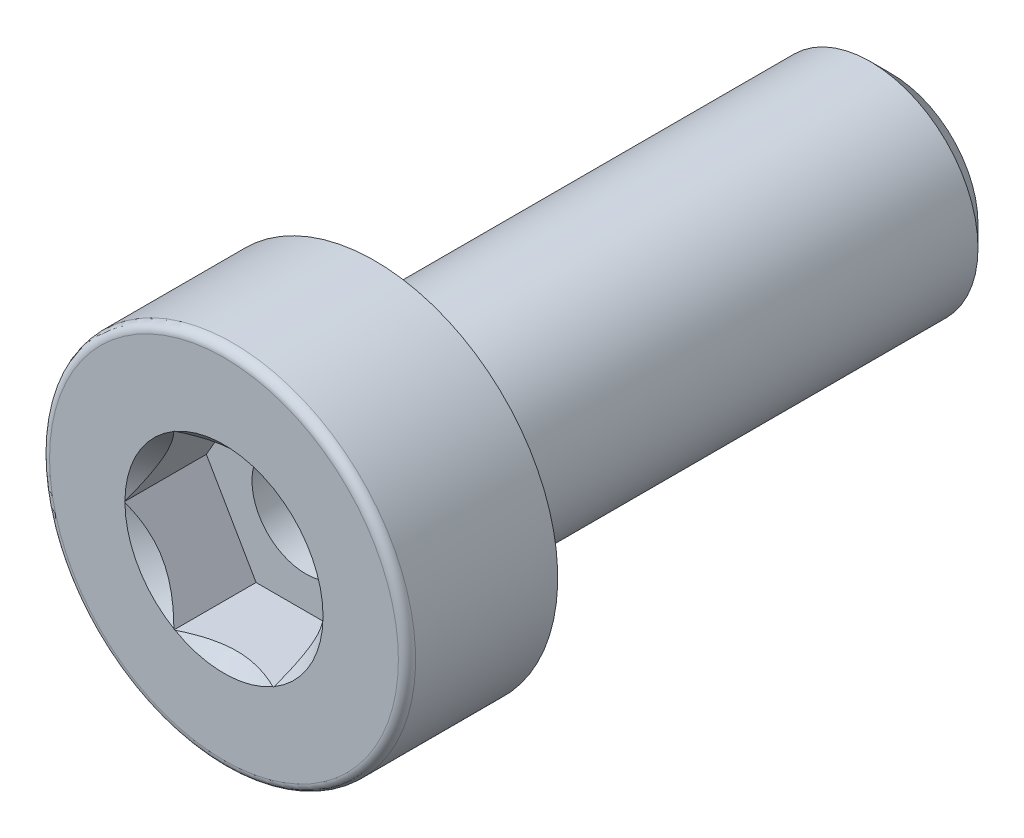
ISO-10303-21;
HEADER;
FILE_DESCRIPTION(('STEP AP214'),'2;1');
FILE_NAME('part.step','',(''),(''),'','','');
FILE_SCHEMA(('AUTOMOTIVE_DESIGN { 1 0 10303 214 1 1 1 1 }'));
ENDSEC;
DATA;
#1=APPLICATION_CONTEXT('core data for automotive mechanical design processes');
#2=APPLICATION_PROTOCOL_DEFINITION('international standard','automotive_design',2000,#1);
#3=PRODUCT_CONTEXT('',#1,'mechanical');
#4=PRODUCT('Part','Part','',(#3));
#5=PRODUCT_RELATED_PRODUCT_CATEGORY('part','',(#4));
#6=PRODUCT_DEFINITION_FORMATION('','',#4);
#7=PRODUCT_DEFINITION_CONTEXT('part definition',#1,'design');
#8=PRODUCT_DEFINITION('design','',#6,#7);
#9=PRODUCT_DEFINITION_SHAPE('','',#8);
#10=(LENGTH_UNIT() NAMED_UNIT(*) SI_UNIT(.MILLI.,.METRE.));
#11=(NAMED_UNIT(*) PLANE_ANGLE_UNIT() SI_UNIT($,.RADIAN.));
#12=(NAMED_UNIT(*) SI_UNIT($,.STERADIAN.) SOLID_ANGLE_UNIT());
#13=UNCERTAINTY_MEASURE_WITH_UNIT(LENGTH_MEASURE(1.E-05),#10,'distance_accuracy_value','');
#14=(GEOMETRIC_REPRESENTATION_CONTEXT(3) GLOBAL_UNCERTAINTY_ASSIGNED_CONTEXT((#13)) GLOBAL_UNIT_ASSIGNED_CONTEXT((#10,
#11,#12)) REPRESENTATION_CONTEXT('',''));
#15=CARTESIAN_POINT('',(0.,0.,0.));
#16=DIRECTION('',(0.,0.,1.));
#17=DIRECTION('',(1.,0.,0.));
#18=AXIS2_PLACEMENT_3D('',#15,#16,#17);
#19=CARTESIAN_POINT('',(-7.75000000000001,-13.4233937586588,3.50000000003092));
#20=DIRECTION('',(0.,0.,1.));
#21=DIRECTION('',(1.,0.,0.));
#22=AXIS2_PLACEMENT_3D('',#19,#20,#21);
#23=CONICAL_SURFACE('',#22,1.25000000000113,1.04719755116303);
#24=CARTESIAN_POINT('',(-7.75000000000001,-13.4233937586588,3.5));
#25=DIRECTION('',(0.,0.,-1.));
#26=DIRECTION('',(-1.,0.,0.));
#27=AXIS2_PLACEMENT_3D('',#24,#25,#26);
#28=CIRCLE('',#27,1.25);
#29=CARTESIAN_POINT('',(-9.00000000000001,-13.4233937586588,3.5));
#30=VERTEX_POINT('',#29);
#31=EDGE_CURVE('E387',#30,#30,#28,.F.);
#32=ORIENTED_EDGE('',*,*,#31,.T.);
#33=EDGE_LOOP('',(#32));
#34=FACE_BOUND('',#33,.T.);
#35=CARTESIAN_POINT('',(-7.75000000000001,-13.4233937586588,2.77831216351387));
#36=VERTEX_POINT('',#35);
#37=VERTEX_LOOP('',#36);
#38=FACE_BOUND('',#37,.T.);
#39=ADVANCED_FACE('F16',(#34,#38),#23,.F.);
#40=CARTESIAN_POINT('',(-7.75000000000001,-13.4233937586588,5.5));
#41=DIRECTION('',(0.,0.,-1.));
#42=DIRECTION('',(-1.,0.,0.));
#43=AXIS2_PLACEMENT_3D('',#40,#41,#42);
#44=CYLINDRICAL_SURFACE('',#43,1.25);
#45=ORIENTED_EDGE('',*,*,#31,.F.);
#46=EDGE_LOOP('',(#45));
#47=FACE_BOUND('',#46,.T.);
#48=CARTESIAN_POINT('',(-7.75000000000001,-13.4233937586588,5.6));
#49=DIRECTION('',(0.,0.,-1.));
#50=DIRECTION('',(-1.,0.,0.));
#51=AXIS2_PLACEMENT_3D('',#48,#49,#50);
#52=CIRCLE('',#51,1.25);
#53=CARTESIAN_POINT('',(-9.00000000000001,-13.4233937586588,5.6));
#54=VERTEX_POINT('',#53);
#55=EDGE_CURVE('E343',#54,#54,#52,.T.);
#56=ORIENTED_EDGE('',*,*,#55,.F.);
#57=EDGE_LOOP('',(#56));
#58=FACE_BOUND('',#57,.T.);
#59=ADVANCED_FACE('F438',(#47,#58),#44,.F.);
#60=CARTESIAN_POINT('',(-7.75000000000001,-13.4233937586588,5.6));
#61=DIRECTION('',(0.,0.,1.));
#62=DIRECTION('',(1.,0.,0.));
#63=AXIS2_PLACEMENT_3D('',#60,#61,#62);
#64=PLANE('',#63);
#65=DIRECTION('',(1.,0.,0.));
#66=VECTOR('',#65,1.);
#67=CARTESIAN_POINT('',(-8.90470053837926,-15.4233937586588,5.6));
#68=LINE('',#67,#66);
#69=CARTESIAN_POINT('',(-8.90470053837925,-15.4233937586588,5.6));
#70=VERTEX_POINT('',#69);
#71=CARTESIAN_POINT('',(-6.59529946162076,-15.4233937586588,5.6));
#72=VERTEX_POINT('',#71);
#73=EDGE_CURVE('E318',#70,#72,#68,.T.);
#74=ORIENTED_EDGE('',*,*,#73,.T.);
#75=DIRECTION('',(0.5,0.866025403784439,0.));
#76=VECTOR('',#75,1.);
#77=CARTESIAN_POINT('',(-6.59529946162076,-15.4233937586588,5.6));
#78=LINE('',#77,#76);
#79=CARTESIAN_POINT('',(-5.44059892324151,-13.4233937586588,5.6));
#80=VERTEX_POINT('',#79);
#81=EDGE_CURVE('E328',#72,#80,#78,.T.);
#82=ORIENTED_EDGE('',*,*,#81,.T.);
#83=DIRECTION('',(-0.500000000000001,0.866025403784438,0.));
#84=VECTOR('',#83,1.);
#85=CARTESIAN_POINT('',(-5.4405989232415,-13.4233937586588,5.6));
#86=LINE('',#85,#84);
#87=CARTESIAN_POINT('',(-6.59529946162076,-11.4233937586588,5.6));
#88=VERTEX_POINT('',#87);
#89=EDGE_CURVE('E337',#80,#88,#86,.T.);
#90=ORIENTED_EDGE('',*,*,#89,.T.);
#91=DIRECTION('',(-1.,0.,0.));
#92=VECTOR('',#91,1.);
#93=CARTESIAN_POINT('',(-6.59529946162076,-11.4233937586588,5.6));
#94=LINE('',#93,#92);
#95=CARTESIAN_POINT('',(-8.90470053837926,-11.4233937586588,5.6));
#96=VERTEX_POINT('',#95);
#97=EDGE_CURVE('E128',#88,#96,#94,.T.);
#98=ORIENTED_EDGE('',*,*,#97,.T.);
#99=DIRECTION('',(-0.5,-0.866025403784439,0.));
#100=VECTOR('',#99,1.);
#101=CARTESIAN_POINT('',(-8.90470053837926,-11.4233937586588,5.6));
#102=LINE('',#101,#100);
#103=CARTESIAN_POINT('',(-10.0594010767585,-13.4233937586588,5.6));
#104=VERTEX_POINT('',#103);
#105=EDGE_CURVE('E348',#96,#104,#102,.T.);
#106=ORIENTED_EDGE('',*,*,#105,.T.);
#107=DIRECTION('',(0.500000000000001,-0.866025403784438,0.));
#108=VECTOR('',#107,1.);
#109=CARTESIAN_POINT('',(-10.0594010767585,-13.4233937586588,5.6));
#110=LINE('',#109,#108);
#111=EDGE_CURVE('E308',#104,#70,#110,.T.);
#112=ORIENTED_EDGE('',*,*,#111,.T.);
#113=EDGE_LOOP('',(#74,#82,#90,#98,#106,#112));
#114=FACE_BOUND('',#113,.T.);
#115=ORIENTED_EDGE('',*,*,#55,.T.);
#116=EDGE_LOOP('',(#115));
#117=FACE_BOUND('',#116,.T.);
#118=ADVANCED_FACE('F435',(#114,#117),#64,.T.);
#119=CARTESIAN_POINT('',(-6.59529946162076,-11.4233937586588,7.5));
#120=DIRECTION('',(0.,1.,0.));
#121=DIRECTION('',(-1.,0.,0.));
#122=AXIS2_PLACEMENT_3D('',#119,#120,#121);
#123=PLANE('',#122);
#124=DIRECTION('',(-1.,0.,0.));
#125=VECTOR('',#124,1.);
#126=CARTESIAN_POINT('',(-6.59529946162076,-11.4233937586588,7.5));
#127=LINE('',#126,#125);
#128=CARTESIAN_POINT('',(-8.90470053837926,-11.4233937586588,7.5));
#129=VERTEX_POINT('',#128);
#130=CARTESIAN_POINT('',(-8.88578166915467,-11.4233937586588,7.49999999996817));
#131=VERTEX_POINT('',#130);
#132=EDGE_CURVE('E119',#129,#131,#127,.F.);
#133=ORIENTED_EDGE('',*,*,#132,.F.);
#134=DIRECTION('',(0.,0.,1.));
#135=VECTOR('',#134,1.);
#136=CARTESIAN_POINT('',(-8.90470053837926,-11.4233937586588,7.5));
#137=LINE('',#136,#135);
#138=EDGE_CURVE('E298',#129,#96,#137,.F.);
#139=ORIENTED_EDGE('',*,*,#138,.T.);
#140=ORIENTED_EDGE('',*,*,#97,.F.);
#141=DIRECTION('',(0.,0.,1.));
#142=VECTOR('',#141,1.);
#143=CARTESIAN_POINT('',(-6.59529946162076,-11.4233937586588,7.5));
#144=LINE('',#143,#142);
#145=CARTESIAN_POINT('',(-6.59529946162076,-11.4233937586588,7.5));
#146=VERTEX_POINT('',#145);
#147=EDGE_CURVE('E333',#88,#146,#144,.T.);
#148=ORIENTED_EDGE('',*,*,#147,.T.);
#149=DIRECTION('',(-1.,0.,0.));
#150=VECTOR('',#149,1.);
#151=CARTESIAN_POINT('',(-6.59529946162076,-11.4233937586588,7.5));
#152=LINE('',#151,#150);
#153=CARTESIAN_POINT('',(-6.61421833084535,-11.4233937586588,7.49999999996817));
#154=VERTEX_POINT('',#153);
#155=EDGE_CURVE('E113',#154,#146,#152,.F.);
#156=ORIENTED_EDGE('',*,*,#155,.F.);
#157=CARTESIAN_POINT('',(-6.61421833084231,-11.4233937586588,7.49999999996967));
#158=CARTESIAN_POINT('',(-6.69246986560371,-11.4233937586588,7.46139126550869));
#159=CARTESIAN_POINT('',(-6.7720183246467,-11.4233937586588,7.42509450591187));
#160=CARTESIAN_POINT('',(-6.93416048945859,-11.4233937586588,7.35871592056121));
#161=CARTESIAN_POINT('',(-7.01676864816183,-11.4233937586588,7.32866971216834));
#162=CARTESIAN_POINT('',(-7.18333080911163,-11.4233937586588,7.27724746086869));
#163=CARTESIAN_POINT('',(-7.26724496590205,-11.4233937586588,7.25574596550051));
#164=CARTESIAN_POINT('',(-7.43686525690513,-11.4233937586588,7.22266553530585));
#165=CARTESIAN_POINT('',(-7.52256661492198,-11.4233937586588,7.21106294551237));
#166=CARTESIAN_POINT('',(-7.67120897584387,-11.4233937586588,7.20057444952879));
#167=CARTESIAN_POINT('',(-7.73397281472532,-11.4233937586588,7.19908068827765));
#168=CARTESIAN_POINT('',(-7.85938715071772,-11.4233937586588,7.20200867405301));
#169=CARTESIAN_POINT('',(-7.92203760144415,-11.4233937586588,7.20643245497149));
#170=CARTESIAN_POINT('',(-8.04673344056696,-11.4233937586588,7.22094215820634));
#171=CARTESIAN_POINT('',(-8.10877812157187,-11.4233937586588,7.23103404393765));
#172=CARTESIAN_POINT('',(-8.23179523498425,-11.4233937586588,7.2563322923858));
#173=CARTESIAN_POINT('',(-8.29276775326558,-11.4233937586588,7.27153824351484));
#174=CARTESIAN_POINT('',(-8.44510307009204,-11.4233937586588,7.31551246792522));
#175=CARTESIAN_POINT('',(-8.53560806284398,-11.4233937586588,7.34720930830145));
#176=CARTESIAN_POINT('',(-8.71319977090982,-11.4233937586588,7.41837525264462));
#177=CARTESIAN_POINT('',(-8.80029669954382,-11.4233937586588,7.45781859302261));
#178=CARTESIAN_POINT('',(-8.8857816691577,-11.4233937586588,7.49999999996967));
#179=B_SPLINE_CURVE_WITH_KNOTS('',3,(#157,#158,#159,#160,#161,#162,#163,#164,#165,#166,#167,
#168,#169,#170,#171,#172,#173,#174,#175,#176,#177,#178),.UNSPECIFIED.,.F.,.F.,(4,2,2,2,2,2,2,2,
2,2,4),(0.,0.261948226178636,0.525350520205879,0.78472845281586,1.04348481161264,
1.23156297192898,1.41970579236232,1.60804692971838,1.79637291271818,2.08361007435315,
2.36990763369225),.UNSPECIFIED.);
#180=EDGE_CURVE('E130',#154,#131,#179,.T.);
#181=ORIENTED_EDGE('',*,*,#180,.T.);
#182=EDGE_LOOP('',(#133,#139,#140,#148,#156,#181));
#183=FACE_BOUND('',#182,.T.);
#184=ADVANCED_FACE('F131',(#183),#123,.F.);
#185=CARTESIAN_POINT('',(-5.4405989232415,-13.4233937586588,7.5));
#186=DIRECTION('',(0.866025403784438,0.500000000000001,0.));
#187=DIRECTION('',(-0.500000000000001,0.866025403784438,0.));
#188=AXIS2_PLACEMENT_3D('',#185,#186,#187);
#189=PLANE('',#188);
#190=DIRECTION('',(-0.500000000000001,0.866025403784438,0.));
#191=VECTOR('',#190,1.);
#192=CARTESIAN_POINT('',(-5.4405989232415,-13.4233937586588,7.5));
#193=LINE('',#192,#191);
#194=CARTESIAN_POINT('',(-6.58584002700846,-11.4397779800182,7.49999999996817));
#195=VERTEX_POINT('',#194);
#196=EDGE_CURVE('E329',#146,#195,#193,.F.);
#197=ORIENTED_EDGE('',*,*,#196,.F.);
#198=ORIENTED_EDGE('',*,*,#147,.F.);
#199=ORIENTED_EDGE('',*,*,#89,.F.);
#200=DIRECTION('',(0.,0.,1.));
#201=VECTOR('',#200,1.);
#202=CARTESIAN_POINT('',(-5.44059892324151,-13.4233937586588,7.5));
#203=LINE('',#202,#201);
#204=CARTESIAN_POINT('',(-5.4405989232415,-13.4233937586588,7.5));
#205=VERTEX_POINT('',#204);
#206=EDGE_CURVE('E323',#80,#205,#203,.T.);
#207=ORIENTED_EDGE('',*,*,#206,.T.);
#208=DIRECTION('',(-0.500000000000001,0.866025403784438,0.));
#209=VECTOR('',#208,1.);
#210=CARTESIAN_POINT('',(-5.4405989232415,-13.4233937586588,7.5));
#211=LINE('',#210,#209);
#212=CARTESIAN_POINT('',(-5.4500583578538,-13.4070095372994,7.49999999996817));
#213=VERTEX_POINT('',#212);
#214=EDGE_CURVE('E127',#213,#205,#211,.F.);
#215=ORIENTED_EDGE('',*,*,#214,.F.);
#216=CARTESIAN_POINT('',(-5.45005835785228,-13.4070095373021,7.49999999996967));
#217=CARTESIAN_POINT('',(-5.48918412523298,-13.3392417203136,7.4613912655087));
#218=CARTESIAN_POINT('',(-5.52895835475448,-13.2703507339504,7.42509450591187));
#219=CARTESIAN_POINT('',(-5.61002943716042,-13.1299315001987,7.35871592056121));
#220=CARTESIAN_POINT('',(-5.65133351651204,-13.0583907362019,7.32866971216835));
#221=CARTESIAN_POINT('',(-5.73461459698694,-12.9141436735101,7.27724746086869));
#222=CARTESIAN_POINT('',(-5.77657167538215,-12.8414718819925,7.25574596550051));
#223=CARTESIAN_POINT('',(-5.86138182088369,-12.6945764009865,7.22266553530585));
#224=CARTESIAN_POINT('',(-5.90423249989211,-12.6203568478051,7.21106294551238));
#225=CARTESIAN_POINT('',(-5.97855368035306,-12.4916287871682,7.20057444952879));
#226=CARTESIAN_POINT('',(-6.00993559979379,-12.4372737082578,7.19908068827766));
#227=CARTESIAN_POINT('',(-6.07264276778999,-12.3286617072897,7.20200867405301));
#228=CARTESIAN_POINT('',(-6.1039679931532,-12.274404825402,7.20643245497149));
#229=CARTESIAN_POINT('',(-6.1663159127146,-12.1664150609755,7.22094215820635));
#230=CARTESIAN_POINT('',(-6.19733825321706,-12.1126827910555,7.23103404393766));
#231=CARTESIAN_POINT('',(-6.25884680992325,-12.0061468457402,7.2563322923858));
#232=CARTESIAN_POINT('',(-6.28933306906392,-11.9533430959758,7.27153824351485));
#233=CARTESIAN_POINT('',(-6.36550072747714,-11.8214168417105,7.31551246792522));
#234=CARTESIAN_POINT('',(-6.41075322385311,-11.743037218818,7.34720930830146));
#235=CARTESIAN_POINT('',(-6.49954907788603,-11.5892382881316,7.41837525264462));
#236=CARTESIAN_POINT('',(-6.54309754220303,-11.5138101353429,7.45781859302262));
#237=CARTESIAN_POINT('',(-6.58584002700998,-11.4397779800155,7.49999999996967));
#238=B_SPLINE_CURVE_WITH_KNOTS('',3,(#216,#217,#218,#219,#220,#221,#222,#223,#224,#225,#226,
#227,#228,#229,#230,#231,#232,#233,#234,#235,#236,#237),.UNSPECIFIED.,.F.,.F.,(4,2,2,2,2,2,2,2,
2,2,4),(0.,0.261948226178634,0.525350520205877,0.784728452815856,1.04348481161263,
1.23156297192898,1.41970579236232,1.60804692971837,1.79637291271818,2.08361007435314,
2.36990763369225),.UNSPECIFIED.);
#239=EDGE_CURVE('E133',#213,#195,#238,.T.);
#240=ORIENTED_EDGE('',*,*,#239,.T.);
#241=EDGE_LOOP('',(#197,#198,#199,#207,#215,#240));
#242=FACE_BOUND('',#241,.T.);
#243=ADVANCED_FACE('F204',(#242),#189,.F.);
#244=CARTESIAN_POINT('',(-6.59529946162076,-15.4233937586588,7.5));
#245=DIRECTION('',(0.866025403784439,-0.5,0.));
#246=DIRECTION('',(0.5,0.866025403784439,0.));
#247=AXIS2_PLACEMENT_3D('',#244,#245,#246);
#248=PLANE('',#247);
#249=DIRECTION('',(0.5,0.866025403784439,0.));
#250=VECTOR('',#249,1.);
#251=CARTESIAN_POINT('',(-6.59529946162076,-15.4233937586588,7.5));
#252=LINE('',#251,#250);
#253=CARTESIAN_POINT('',(-5.4500583578538,-13.4397779800182,7.49999999996817));
#254=VERTEX_POINT('',#253);
#255=EDGE_CURVE('E319',#205,#254,#252,.F.);
#256=ORIENTED_EDGE('',*,*,#255,.F.);
#257=ORIENTED_EDGE('',*,*,#206,.F.);
#258=ORIENTED_EDGE('',*,*,#81,.F.);
#259=DIRECTION('',(0.,0.,1.));
#260=VECTOR('',#259,1.);
#261=CARTESIAN_POINT('',(-6.59529946162076,-15.4233937586588,7.5));
#262=LINE('',#261,#260);
#263=CARTESIAN_POINT('',(-6.59529946162076,-15.4233937586588,7.5));
#264=VERTEX_POINT('',#263);
#265=EDGE_CURVE('E313',#72,#264,#262,.T.);
#266=ORIENTED_EDGE('',*,*,#265,.T.);
#267=DIRECTION('',(0.5,0.866025403784439,0.));
#268=VECTOR('',#267,1.);
#269=CARTESIAN_POINT('',(-6.59529946162076,-15.4233937586588,7.5));
#270=LINE('',#269,#268);
#271=CARTESIAN_POINT('',(-6.58584002700847,-15.4070095372994,7.49999999996817));
#272=VERTEX_POINT('',#271);
#273=EDGE_CURVE('E326',#272,#264,#270,.F.);
#274=ORIENTED_EDGE('',*,*,#273,.F.);
#275=CARTESIAN_POINT('',(-6.58584002700998,-15.4070095373021,7.49999999996967));
#276=CARTESIAN_POINT('',(-6.54671425962928,-15.3392417203136,7.46139126550869));
#277=CARTESIAN_POINT('',(-6.50694003010779,-15.2703507339504,7.42509450591187));
#278=CARTESIAN_POINT('',(-6.42586894770185,-15.1299315001987,7.35871592056121));
#279=CARTESIAN_POINT('',(-6.38456486835022,-15.0583907362019,7.32866971216834));
#280=CARTESIAN_POINT('',(-6.30128378787533,-14.9141436735101,7.27724746086869));
#281=CARTESIAN_POINT('',(-6.25932670948011,-14.8414718819925,7.2557459655005));
#282=CARTESIAN_POINT('',(-6.17451656397857,-14.6945764009865,7.22266553530585));
#283=CARTESIAN_POINT('',(-6.13166588497015,-14.6203568478051,7.21106294551237));
#284=CARTESIAN_POINT('',(-6.0573447045092,-14.4916287871682,7.20057444952879));
#285=CARTESIAN_POINT('',(-6.02596278506848,-14.4372737082578,7.19908068827765));
#286=CARTESIAN_POINT('',(-5.96325561707228,-14.3286617072897,7.20200867405301));
#287=CARTESIAN_POINT('',(-5.93193039170906,-14.274404825402,7.20643245497149));
#288=CARTESIAN_POINT('',(-5.86958247214766,-14.1664150609755,7.22094215820634));
#289=CARTESIAN_POINT('',(-5.8385601316452,-14.1126827910555,7.23103404393765));
#290=CARTESIAN_POINT('',(-5.77705157493901,-14.0061468457402,7.25633229238579));
#291=CARTESIAN_POINT('',(-5.74656531579835,-13.9533430959758,7.27153824351484));
#292=CARTESIAN_POINT('',(-5.67039765738512,-13.8214168417105,7.31551246792522));
#293=CARTESIAN_POINT('',(-5.62514516100915,-13.743037218818,7.34720930830145));
#294=CARTESIAN_POINT('',(-5.53634930697623,-13.5892382881316,7.41837525264462));
#295=CARTESIAN_POINT('',(-5.49280084265923,-13.5138101353429,7.45781859302261));
#296=CARTESIAN_POINT('',(-5.45005835785228,-13.4397779800155,7.49999999996967));
#297=B_SPLINE_CURVE_WITH_KNOTS('',3,(#275,#276,#277,#278,#279,#280,#281,#282,#283,#284,#285,
#286,#287,#288,#289,#290,#291,#292,#293,#294,#295,#296),.UNSPECIFIED.,.F.,.F.,(4,2,2,2,2,2,2,2,
2,2,4),(0.,0.261948226178634,0.525350520205877,0.784728452815858,1.04348481161264,
1.23156297192898,1.41970579236232,1.60804692971837,1.79637291271818,2.08361007435315,
2.36990763369226),.UNSPECIFIED.);
#298=EDGE_CURVE('E188',#272,#254,#297,.T.);
#299=ORIENTED_EDGE('',*,*,#298,.T.);
#300=EDGE_LOOP('',(#256,#257,#258,#266,#274,#299));
#301=FACE_BOUND('',#300,.T.);
#302=ADVANCED_FACE('F198',(#301),#248,.F.);
#303=CARTESIAN_POINT('',(-8.90470053837926,-15.4233937586588,7.5));
#304=DIRECTION('',(0.,-1.,0.));
#305=DIRECTION('',(1.,0.,0.));
#306=AXIS2_PLACEMENT_3D('',#303,#304,#305);
#307=PLANE('',#306);
#308=DIRECTION('',(1.,0.,0.));
#309=VECTOR('',#308,1.);
#310=CARTESIAN_POINT('',(-8.90470053837926,-15.4233937586588,7.5));
#311=LINE('',#310,#309);
#312=CARTESIAN_POINT('',(-6.61421833084535,-15.4233937586588,7.49999999996817));
#313=VERTEX_POINT('',#312);
#314=EDGE_CURVE('E309',#264,#313,#311,.F.);
#315=ORIENTED_EDGE('',*,*,#314,.F.);
#316=ORIENTED_EDGE('',*,*,#265,.F.);
#317=ORIENTED_EDGE('',*,*,#73,.F.);
#318=DIRECTION('',(0.,0.,1.));
#319=VECTOR('',#318,1.);
#320=CARTESIAN_POINT('',(-8.90470053837925,-15.4233937586588,7.5));
#321=LINE('',#320,#319);
#322=CARTESIAN_POINT('',(-8.90470053837925,-15.4233937586588,7.5));
#323=VERTEX_POINT('',#322);
#324=EDGE_CURVE('E303',#70,#323,#321,.T.);
#325=ORIENTED_EDGE('',*,*,#324,.T.);
#326=DIRECTION('',(1.,0.,0.));
#327=VECTOR('',#326,1.);
#328=CARTESIAN_POINT('',(-8.90470053837926,-15.4233937586588,7.5));
#329=LINE('',#328,#327);
#330=CARTESIAN_POINT('',(-8.88578166915467,-15.4233937586588,7.49999999996817));
#331=VERTEX_POINT('',#330);
#332=EDGE_CURVE('E316',#331,#323,#329,.F.);
#333=ORIENTED_EDGE('',*,*,#332,.F.);
#334=CARTESIAN_POINT('',(-8.8857816691577,-15.4233937586588,7.49999999996967));
#335=CARTESIAN_POINT('',(-8.8075301343963,-15.4233937586588,7.46139126550869));
#336=CARTESIAN_POINT('',(-8.72798167535332,-15.4233937586588,7.42509450591187));
#337=CARTESIAN_POINT('',(-8.56583951054143,-15.4233937586588,7.35871592056121));
#338=CARTESIAN_POINT('',(-8.48323135183819,-15.4233937586588,7.32866971216834));
#339=CARTESIAN_POINT('',(-8.31666919088839,-15.4233937586588,7.27724746086869));
#340=CARTESIAN_POINT('',(-8.23275503409797,-15.4233937586588,7.25574596550051));
#341=CARTESIAN_POINT('',(-8.06313474309489,-15.4233937586588,7.22266553530585));
#342=CARTESIAN_POINT('',(-7.97743338507805,-15.4233937586588,7.21106294551237));
#343=CARTESIAN_POINT('',(-7.82879102415615,-15.4233937586588,7.20057444952879));
#344=CARTESIAN_POINT('',(-7.7660271852747,-15.4233937586588,7.19908068827765));
#345=CARTESIAN_POINT('',(-7.6406128492823,-15.4233937586588,7.20200867405301));
#346=CARTESIAN_POINT('',(-7.57796239855588,-15.4233937586588,7.20643245497149));
#347=CARTESIAN_POINT('',(-7.45326655943307,-15.4233937586588,7.22094215820634));
#348=CARTESIAN_POINT('',(-7.39122187842815,-15.4233937586588,7.23103404393765));
#349=CARTESIAN_POINT('',(-7.26820476501578,-15.4233937586588,7.2563322923858));
#350=CARTESIAN_POINT('',(-7.20723224673444,-15.4233937586588,7.27153824351484));
#351=CARTESIAN_POINT('',(-7.05489692990799,-15.4233937586588,7.31551246792522));
#352=CARTESIAN_POINT('',(-6.96439193715604,-15.4233937586588,7.34720930830145));
#353=CARTESIAN_POINT('',(-6.7868002290902,-15.4233937586588,7.41837525264462));
#354=CARTESIAN_POINT('',(-6.6997033004562,-15.4233937586588,7.45781859302262));
#355=CARTESIAN_POINT('',(-6.61421833084231,-15.4233937586588,7.49999999996967));
#356=B_SPLINE_CURVE_WITH_KNOTS('',3,(#334,#335,#336,#337,#338,#339,#340,#341,#342,#343,#344,
#345,#346,#347,#348,#349,#350,#351,#352,#353,#354,#355),.UNSPECIFIED.,.F.,.F.,(4,2,2,2,2,2,2,2,
2,2,4),(0.,0.261948226178633,0.525350520205873,0.784728452815851,1.04348481161263,
1.23156297192897,1.41970579236231,1.60804692971836,1.79637291271817,2.08361007435314,
2.36990763369225),.UNSPECIFIED.);
#357=EDGE_CURVE('E181',#331,#313,#356,.T.);
#358=ORIENTED_EDGE('',*,*,#357,.T.);
#359=EDGE_LOOP('',(#315,#316,#317,#325,#333,#358));
#360=FACE_BOUND('',#359,.T.);
#361=ADVANCED_FACE('F194',(#360),#307,.F.);
#362=CARTESIAN_POINT('',(-10.0594010767585,-13.4233937586588,7.5));
#363=DIRECTION('',(-0.866025403784438,-0.500000000000001,0.));
#364=DIRECTION('',(0.500000000000001,-0.866025403784438,0.));
#365=AXIS2_PLACEMENT_3D('',#362,#363,#364);
#366=PLANE('',#365);
#367=DIRECTION('',(0.500000000000001,-0.866025403784438,0.));
#368=VECTOR('',#367,1.);
#369=CARTESIAN_POINT('',(-10.0594010767585,-13.4233937586588,7.5));
#370=LINE('',#369,#368);
#371=CARTESIAN_POINT('',(-8.91415997299153,-15.4070095372994,7.49999999996817));
#372=VERTEX_POINT('',#371);
#373=EDGE_CURVE('E299',#323,#372,#370,.F.);
#374=ORIENTED_EDGE('',*,*,#373,.F.);
#375=ORIENTED_EDGE('',*,*,#324,.F.);
#376=ORIENTED_EDGE('',*,*,#111,.F.);
#377=DIRECTION('',(0.,0.,1.));
#378=VECTOR('',#377,1.);
#379=CARTESIAN_POINT('',(-10.0594010767585,-13.4233937586588,7.5));
#380=LINE('',#379,#378);
#381=CARTESIAN_POINT('',(-10.0594010767585,-13.4233937586588,7.5));
#382=VERTEX_POINT('',#381);
#383=EDGE_CURVE('E294',#104,#382,#380,.T.);
#384=ORIENTED_EDGE('',*,*,#383,.T.);
#385=DIRECTION('',(0.500000000000001,-0.866025403784438,0.));
#386=VECTOR('',#385,1.);
#387=CARTESIAN_POINT('',(-10.0594010767585,-13.4233937586588,7.5));
#388=LINE('',#387,#386);
#389=CARTESIAN_POINT('',(-10.0499416421462,-13.4397779800181,7.49999999996817));
#390=VERTEX_POINT('',#389);
#391=EDGE_CURVE('E306',#390,#382,#388,.F.);
#392=ORIENTED_EDGE('',*,*,#391,.F.);
#393=CARTESIAN_POINT('',(-10.0499416421477,-13.4397779800155,7.49999999996966));
#394=CARTESIAN_POINT('',(-10.010815874767,-13.507545797004,7.46139126550868));
#395=CARTESIAN_POINT('',(-9.97104164524553,-13.5764367833672,7.42509450591186));
#396=CARTESIAN_POINT('',(-9.88997056283959,-13.7168560171189,7.3587159205612));
#397=CARTESIAN_POINT('',(-9.84866648348797,-13.7883967811157,7.32866971216833));
#398=CARTESIAN_POINT('',(-9.76538540301307,-13.9326438438075,7.27724746086868));
#399=CARTESIAN_POINT('',(-9.72342832461786,-14.0053156353251,7.25574596550049));
#400=CARTESIAN_POINT('',(-9.63861817911632,-14.1522111163311,7.22266553530584));
#401=CARTESIAN_POINT('',(-9.59576750010789,-14.2264306695125,7.21106294551236));
#402=CARTESIAN_POINT('',(-9.52144631964695,-14.3551587301494,7.20057444952878));
#403=CARTESIAN_POINT('',(-9.49006440020622,-14.4095138090598,7.19908068827764));
#404=CARTESIAN_POINT('',(-9.42735723221002,-14.5181258100279,7.202008674053));
#405=CARTESIAN_POINT('',(-9.39603200684681,-14.5723826919156,7.20643245497148));
#406=CARTESIAN_POINT('',(-9.33368408728541,-14.6803724563421,7.22094215820633));
#407=CARTESIAN_POINT('',(-9.30266174678295,-14.7341047262621,7.23103404393764));
#408=CARTESIAN_POINT('',(-9.24115319007676,-14.8406406715774,7.25633229238578));
#409=CARTESIAN_POINT('',(-9.21066693093609,-14.8934444213418,7.27153824351483));
#410=CARTESIAN_POINT('',(-9.13449927252286,-15.025370675607,7.3155124679252));
#411=CARTESIAN_POINT('',(-9.08924677614689,-15.1037502984995,7.34720930830144));
#412=CARTESIAN_POINT('',(-9.00045092211397,-15.257549229186,7.4183752526446));
#413=CARTESIAN_POINT('',(-8.95690245779697,-15.3329773819747,7.4578185930226));
#414=CARTESIAN_POINT('',(-8.91415997299002,-15.4070095373021,7.49999999996966));
#415=B_SPLINE_CURVE_WITH_KNOTS('',3,(#393,#394,#395,#396,#397,#398,#399,#400,#401,#402,#403,
#404,#405,#406,#407,#408,#409,#410,#411,#412,#413,#414),.UNSPECIFIED.,.F.,.F.,(4,2,2,2,2,2,2,2,
2,2,4),(0.,0.261948226178637,0.525350520205877,0.784728452815857,1.04348481161263,
1.23156297192897,1.41970579236231,1.60804692971837,1.79637291271817,2.08361007435315,
2.36990763369226),.UNSPECIFIED.);
#416=EDGE_CURVE('E144',#390,#372,#415,.T.);
#417=ORIENTED_EDGE('',*,*,#416,.T.);
#418=EDGE_LOOP('',(#374,#375,#376,#384,#392,#417));
#419=FACE_BOUND('',#418,.T.);
#420=ADVANCED_FACE('F197',(#419),#366,.F.);
#421=CARTESIAN_POINT('',(-8.90470053837926,-11.4233937586588,7.5));
#422=DIRECTION('',(-0.866025403784439,0.5,0.));
#423=DIRECTION('',(-0.5,-0.866025403784439,0.));
#424=AXIS2_PLACEMENT_3D('',#421,#422,#423);
#425=PLANE('',#424);
#426=DIRECTION('',(-0.5,-0.866025403784439,0.));
#427=VECTOR('',#426,1.);
#428=CARTESIAN_POINT('',(-8.90470053837926,-11.4233937586588,7.5));
#429=LINE('',#428,#427);
#430=CARTESIAN_POINT('',(-10.0499416421462,-13.4070095372994,7.49999999996817));
#431=VERTEX_POINT('',#430);
#432=EDGE_CURVE('E134',#382,#431,#429,.F.);
#433=ORIENTED_EDGE('',*,*,#432,.F.);
#434=ORIENTED_EDGE('',*,*,#383,.F.);
#435=ORIENTED_EDGE('',*,*,#105,.F.);
#436=ORIENTED_EDGE('',*,*,#138,.F.);
#437=DIRECTION('',(-0.5,-0.866025403784439,0.));
#438=VECTOR('',#437,1.);
#439=CARTESIAN_POINT('',(-8.90470053837926,-11.4233937586588,7.5));
#440=LINE('',#439,#438);
#441=CARTESIAN_POINT('',(-8.91415997299156,-11.4397779800182,7.49999999996817));
#442=VERTEX_POINT('',#441);
#443=EDGE_CURVE('E124',#442,#129,#440,.F.);
#444=ORIENTED_EDGE('',*,*,#443,.F.);
#445=CARTESIAN_POINT('',(-8.91415997299004,-11.4397779800155,7.49999999996967));
#446=CARTESIAN_POINT('',(-8.95328574037074,-11.507545797004,7.46139126550869));
#447=CARTESIAN_POINT('',(-8.99305996989223,-11.5764367833672,7.42509450591187));
#448=CARTESIAN_POINT('',(-9.07413105229817,-11.7168560171189,7.35871592056121));
#449=CARTESIAN_POINT('',(-9.11543513164979,-11.7883967811157,7.32866971216834));
#450=CARTESIAN_POINT('',(-9.19871621212469,-11.9326438438075,7.27724746086869));
#451=CARTESIAN_POINT('',(-9.2406732905199,-12.0053156353251,7.2557459655005));
#452=CARTESIAN_POINT('',(-9.32548343602145,-12.1522111163311,7.22266553530585));
#453=CARTESIAN_POINT('',(-9.36833411502987,-12.2264306695125,7.21106294551237));
#454=CARTESIAN_POINT('',(-9.44265529549082,-12.3551587301494,7.20057444952879));
#455=CARTESIAN_POINT('',(-9.47403721493154,-12.4095138090598,7.19908068827765));
#456=CARTESIAN_POINT('',(-9.53674438292774,-12.5181258100279,7.20200867405301));
#457=CARTESIAN_POINT('',(-9.56806960829095,-12.5723826919156,7.20643245497149));
#458=CARTESIAN_POINT('',(-9.63041752785236,-12.6803724563421,7.22094215820634));
#459=CARTESIAN_POINT('',(-9.66143986835481,-12.7341047262621,7.23103404393765));
#460=CARTESIAN_POINT('',(-9.722948425061,-12.8406406715774,7.25633229238579));
#461=CARTESIAN_POINT('',(-9.75343468420167,-12.8934444213418,7.27153824351484));
#462=CARTESIAN_POINT('',(-9.8296023426149,-13.025370675607,7.31551246792522));
#463=CARTESIAN_POINT('',(-9.87485483899087,-13.1037502984996,7.34720930830145));
#464=CARTESIAN_POINT('',(-9.96365069302379,-13.257549229186,7.41837525264461));
#465=CARTESIAN_POINT('',(-10.0071991573408,-13.3329773819747,7.45781859302261));
#466=CARTESIAN_POINT('',(-10.0499416421477,-13.4070095373021,7.49999999996967));
#467=B_SPLINE_CURVE_WITH_KNOTS('',3,(#445,#446,#447,#448,#449,#450,#451,#452,#453,#454,#455,
#456,#457,#458,#459,#460,#461,#462,#463,#464,#465,#466),.UNSPECIFIED.,.F.,.F.,(4,2,2,2,2,2,2,2,
2,2,4),(0.,0.261948226178632,0.525350520205876,0.784728452815856,1.04348481161263,
1.23156297192897,1.41970579236231,1.60804692971836,1.79637291271817,2.08361007435314,
2.36990763369225),.UNSPECIFIED.);
#468=EDGE_CURVE('E138',#442,#431,#467,.T.);
#469=ORIENTED_EDGE('',*,*,#468,.T.);
#470=EDGE_LOOP('',(#433,#434,#435,#436,#444,#469));
#471=FACE_BOUND('',#470,.T.);
#472=ADVANCED_FACE('F159',(#471),#425,.F.);
#473=CARTESIAN_POINT('',(-7.75000000000001,-13.4233937586588,7.49999999987949));
#474=DIRECTION('',(0.,0.,1.));
#475=DIRECTION('',(1.,0.,0.));
#476=AXIS2_PLACEMENT_3D('',#473,#474,#475);
#477=CONICAL_SURFACE('',#476,2.29999999990866,0.785398163396903);
#478=CARTESIAN_POINT('',(-7.75000000000001,-13.4233937586588,7.49999999993634));
#479=DIRECTION('',(0.,0.,1.));
#480=DIRECTION('',(1.,0.,0.));
#481=AXIS2_PLACEMENT_3D('',#478,#479,#480);
#482=CIRCLE('',#481,2.2999999999655);
#483=EDGE_CURVE('E122',#131,#154,#482,.F.);
#484=ORIENTED_EDGE('',*,*,#483,.F.);
#485=ORIENTED_EDGE('',*,*,#180,.F.);
#486=EDGE_LOOP('',(#484,#485));
#487=FACE_BOUND('',#486,.T.);
#488=ADVANCED_FACE('F136',(#487),#477,.F.);
#489=CARTESIAN_POINT('',(-7.75000000000001,-13.4233937586588,7.49999999987949));
#490=DIRECTION('',(0.,0.,1.));
#491=DIRECTION('',(1.,0.,0.));
#492=AXIS2_PLACEMENT_3D('',#489,#490,#491);
#493=CONICAL_SURFACE('',#492,2.29999999990866,0.785398163396903);
#494=CARTESIAN_POINT('',(-7.75000000000001,-13.4233937586588,7.49999999993634));
#495=DIRECTION('',(0.,0.,1.));
#496=DIRECTION('',(1.,0.,0.));
#497=AXIS2_PLACEMENT_3D('',#494,#495,#496);
#498=CIRCLE('',#497,2.2999999999655);
#499=EDGE_CURVE('E137',#195,#213,#498,.F.);
#500=ORIENTED_EDGE('',*,*,#499,.F.);
#501=ORIENTED_EDGE('',*,*,#239,.F.);
#502=EDGE_LOOP('',(#500,#501));
#503=FACE_BOUND('',#502,.T.);
#504=ADVANCED_FACE('F220',(#503),#493,.F.);
#505=CARTESIAN_POINT('',(-7.75000000000001,-13.4233937586588,7.49999999987949));
#506=DIRECTION('',(0.,0.,1.));
#507=DIRECTION('',(1.,0.,0.));
#508=AXIS2_PLACEMENT_3D('',#505,#506,#507);
#509=CONICAL_SURFACE('',#508,2.29999999990866,0.785398163396903);
#510=CARTESIAN_POINT('',(-7.75000000000001,-13.4233937586588,7.49999999993634));
#511=DIRECTION('',(0.,0.,1.));
#512=DIRECTION('',(1.,0.,0.));
#513=AXIS2_PLACEMENT_3D('',#510,#511,#512);
#514=CIRCLE('',#513,2.2999999999655);
#515=EDGE_CURVE('E141',#254,#272,#514,.F.);
#516=ORIENTED_EDGE('',*,*,#515,.F.);
#517=ORIENTED_EDGE('',*,*,#298,.F.);
#518=EDGE_LOOP('',(#516,#517));
#519=FACE_BOUND('',#518,.T.);
#520=ADVANCED_FACE('F177',(#519),#509,.F.);
#521=CARTESIAN_POINT('',(-7.75000000000001,-13.4233937586588,7.49999999987949));
#522=DIRECTION('',(0.,0.,1.));
#523=DIRECTION('',(1.,0.,0.));
#524=AXIS2_PLACEMENT_3D('',#521,#522,#523);
#525=CONICAL_SURFACE('',#524,2.29999999990866,0.785398163396903);
#526=CARTESIAN_POINT('',(-7.75000000000001,-13.4233937586588,7.49999999993634));
#527=DIRECTION('',(0.,0.,1.));
#528=DIRECTION('',(1.,0.,0.));
#529=AXIS2_PLACEMENT_3D('',#526,#527,#528);
#530=CIRCLE('',#529,2.2999999999655);
#531=EDGE_CURVE('E401',#313,#331,#530,.F.);
#532=ORIENTED_EDGE('',*,*,#531,.F.);
#533=ORIENTED_EDGE('',*,*,#357,.F.);
#534=EDGE_LOOP('',(#532,#533));
#535=FACE_BOUND('',#534,.T.);
#536=ADVANCED_FACE('F172',(#535),#525,.F.);
#537=CARTESIAN_POINT('',(-7.75000000000001,-13.4233937586588,7.49999999987949));
#538=DIRECTION('',(0.,0.,1.));
#539=DIRECTION('',(1.,0.,0.));
#540=AXIS2_PLACEMENT_3D('',#537,#538,#539);
#541=CONICAL_SURFACE('',#540,2.29999999990866,0.785398163396903);
#542=CARTESIAN_POINT('',(-7.75000000000001,-13.4233937586588,7.49999999993634));
#543=DIRECTION('',(0.,0.,1.));
#544=DIRECTION('',(1.,0.,0.));
#545=AXIS2_PLACEMENT_3D('',#542,#543,#544);
#546=CIRCLE('',#545,2.2999999999655);
#547=EDGE_CURVE('E398',#372,#390,#546,.F.);
#548=ORIENTED_EDGE('',*,*,#547,.F.);
#549=ORIENTED_EDGE('',*,*,#416,.F.);
#550=EDGE_LOOP('',(#548,#549));
#551=FACE_BOUND('',#550,.T.);
#552=ADVANCED_FACE('F166',(#551),#541,.F.);
#553=CARTESIAN_POINT('',(-7.75000000000001,-13.4233937586588,7.49999999987949));
#554=DIRECTION('',(0.,0.,1.));
#555=DIRECTION('',(1.,0.,0.));
#556=AXIS2_PLACEMENT_3D('',#553,#554,#555);
#557=CONICAL_SURFACE('',#556,2.29999999990866,0.785398163396903);
#558=CARTESIAN_POINT('',(-7.75000000000001,-13.4233937586588,7.49999999993634));
#559=DIRECTION('',(0.,0.,1.));
#560=DIRECTION('',(1.,0.,0.));
#561=AXIS2_PLACEMENT_3D('',#558,#559,#560);
#562=CIRCLE('',#561,2.2999999999655);
#563=EDGE_CURVE('E396',#431,#442,#562,.F.);
#564=ORIENTED_EDGE('',*,*,#563,.F.);
#565=ORIENTED_EDGE('',*,*,#468,.F.);
#566=EDGE_LOOP('',(#564,#565));
#567=FACE_BOUND('',#566,.T.);
#568=ADVANCED_FACE('F162',(#567),#557,.F.);
#569=CARTESIAN_POINT('',(-9.33750000000001,-16.1730244156744,7.5));
#570=DIRECTION('',(0.,0.,1.));
#571=DIRECTION('',(1.,0.,0.));
#572=AXIS2_PLACEMENT_3D('',#569,#570,#571);
#573=PLANE('',#572);
#574=ORIENTED_EDGE('',*,*,#432,.T.);
#575=ORIENTED_EDGE('',*,*,#563,.T.);
#576=ORIENTED_EDGE('',*,*,#443,.T.);
#577=ORIENTED_EDGE('',*,*,#132,.T.);
#578=ORIENTED_EDGE('',*,*,#483,.T.);
#579=ORIENTED_EDGE('',*,*,#155,.T.);
#580=ORIENTED_EDGE('',*,*,#196,.T.);
#581=ORIENTED_EDGE('',*,*,#499,.T.);
#582=ORIENTED_EDGE('',*,*,#214,.T.);
#583=ORIENTED_EDGE('',*,*,#255,.T.);
#584=ORIENTED_EDGE('',*,*,#515,.T.);
#585=ORIENTED_EDGE('',*,*,#273,.T.);
#586=ORIENTED_EDGE('',*,*,#314,.T.);
#587=ORIENTED_EDGE('',*,*,#531,.T.);
#588=ORIENTED_EDGE('',*,*,#332,.T.);
#589=ORIENTED_EDGE('',*,*,#373,.T.);
#590=ORIENTED_EDGE('',*,*,#547,.T.);
#591=ORIENTED_EDGE('',*,*,#391,.T.);
#592=EDGE_LOOP('',(#574,#575,#576,#577,#578,#579,#580,#581,#582,#583,#584,#585,#586,#587,#588,
#589,#590,#591));
#593=FACE_BOUND('',#592,.T.);
#594=CARTESIAN_POINT('',(-7.75000000000001,-13.4233937586588,7.5));
#595=DIRECTION('',(0.,0.,-1.));
#596=DIRECTION('',(0.499999999999999,0.866025403784439,0.));
#597=AXIS2_PLACEMENT_3D('',#594,#595,#596);
#598=CIRCLE('',#597,4.05000000000001);
#599=CARTESIAN_POINT('',(-5.72500000000001,-9.91599087333181,7.5));
#600=VERTEX_POINT('',#599);
#601=CARTESIAN_POINT('',(-9.77500000000001,-16.9307966439858,7.5));
#602=VERTEX_POINT('',#601);
#603=EDGE_CURVE('E35',#600,#602,#598,.T.);
#604=ORIENTED_EDGE('',*,*,#603,.F.);
#605=CARTESIAN_POINT('',(-7.75000000000001,-13.4233937586588,7.5));
#606=DIRECTION('',(0.,0.,-1.));
#607=DIRECTION('',(-0.5,-0.866025403784439,0.));
#608=AXIS2_PLACEMENT_3D('',#605,#606,#607);
#609=CIRCLE('',#608,4.05000000000002);
#610=EDGE_CURVE('E276',#602,#600,#609,.T.);
#611=ORIENTED_EDGE('',*,*,#610,.F.);
#612=EDGE_LOOP('',(#604,#611));
#613=FACE_BOUND('',#612,.T.);
#614=ADVANCED_FACE('F120',(#593,#613),#573,.T.);
#615=CARTESIAN_POINT('',(-7.75000000000001,-13.4233937586588,7.3));
#616=DIRECTION('',(0.,0.,1.));
#617=DIRECTION('',(-0.5,-0.866025403784439,0.));
#618=AXIS2_PLACEMENT_3D('',#615,#616,#617);
#619=TOROIDAL_SURFACE('',#618,4.05,0.199999999999999);
#620=ORIENTED_EDGE('',*,*,#603,.T.);
#621=ORIENTED_EDGE('',*,*,#610,.T.);
#622=EDGE_LOOP('',(#620,#621));
#623=FACE_BOUND('',#622,.T.);
#624=CARTESIAN_POINT('',(-7.75000000000001,-13.4233937586588,7.3));
#625=DIRECTION('',(0.,0.,-1.));
#626=DIRECTION('',(-1.,0.,0.));
#627=AXIS2_PLACEMENT_3D('',#624,#625,#626);
#628=CIRCLE('',#627,4.25);
#629=CARTESIAN_POINT('',(-12.,-13.4233937586588,7.3));
#630=VERTEX_POINT('',#629);
#631=EDGE_CURVE('E264',#630,#630,#628,.T.);
#632=ORIENTED_EDGE('',*,*,#631,.F.);
#633=EDGE_LOOP('',(#632));
#634=FACE_BOUND('',#633,.T.);
#635=ADVANCED_FACE('F254',(#623,#634),#619,.T.);
#636=CARTESIAN_POINT('',(-8.25237500000001,-14.2935327831112,-8.));
#637=DIRECTION('',(0.,0.,-1.));
#638=DIRECTION('',(-1.,0.,0.));
#639=AXIS2_PLACEMENT_3D('',#636,#637,#638);
#640=PLANE('',#639);
#641=CARTESIAN_POINT('',(-7.75000000000001,-13.4233937586588,-7.99999999998136));
#642=DIRECTION('',(0.,0.,1.));
#643=DIRECTION('',(1.,0.,0.));
#644=AXIS2_PLACEMENT_3D('',#641,#642,#643);
#645=CIRCLE('',#644,2.00950000004831);
#646=CARTESIAN_POINT('',(-5.7404999999517,-13.4233937586588,-7.99999999998136));
#647=VERTEX_POINT('',#646);
#648=EDGE_CURVE('E393',#647,#647,#645,.T.);
#649=ORIENTED_EDGE('',*,*,#648,.F.);
#650=EDGE_LOOP('',(#649));
#651=FACE_BOUND('',#650,.T.);
#652=ADVANCED_FACE('F251',(#651),#640,.T.);
#653=CARTESIAN_POINT('',(-7.75000000000001,-13.4233937586588,5.65));
#654=DIRECTION('',(0.,0.,-1.));
#655=DIRECTION('',(-1.,0.,0.));
#656=AXIS2_PLACEMENT_3D('',#653,#654,#655);
#657=CYLINDRICAL_SURFACE('',#656,4.25);
#658=ORIENTED_EDGE('',*,*,#631,.T.);
#659=EDGE_LOOP('',(#658));
#660=FACE_BOUND('',#659,.T.);
#661=CARTESIAN_POINT('',(-7.75000000000001,-13.4233937586588,4.));
#662=DIRECTION('',(0.,0.,-1.));
#663=DIRECTION('',(-1.,0.,0.));
#664=AXIS2_PLACEMENT_3D('',#661,#662,#663);
#665=CIRCLE('',#664,4.25);
#666=CARTESIAN_POINT('',(-12.,-13.4233937586588,4.));
#667=VERTEX_POINT('',#666);
#668=EDGE_CURVE('E390',#667,#667,#665,.T.);
#669=ORIENTED_EDGE('',*,*,#668,.F.);
#670=EDGE_LOOP('',(#669));
#671=FACE_BOUND('',#670,.T.);
#672=ADVANCED_FACE('F247',(#660,#671),#657,.T.);
#673=CARTESIAN_POINT('',(-7.75000000000001,-13.4233937586588,-7.50950000002604));
#674=DIRECTION('',(0.,0.,1.));
#675=DIRECTION('',(1.,0.,0.));
#676=AXIS2_PLACEMENT_3D('',#673,#674,#675);
#677=CONICAL_SURFACE('',#676,2.49999999993428,0.785398163326754);
#678=ORIENTED_EDGE('',*,*,#648,.T.);
#679=EDGE_LOOP('',(#678));
#680=FACE_BOUND('',#679,.T.);
#681=CARTESIAN_POINT('',(-7.75000000000001,-13.4233937586588,-7.5095));
#682=DIRECTION('',(0.,0.,-1.));
#683=DIRECTION('',(-1.,0.,0.));
#684=AXIS2_PLACEMENT_3D('',#681,#682,#683);
#685=CIRCLE('',#684,2.5);
#686=CARTESIAN_POINT('',(-10.25,-13.4233937586588,-7.5095));
#687=VERTEX_POINT('',#686);
#688=EDGE_CURVE('E27',#687,#687,#685,.F.);
#689=ORIENTED_EDGE('',*,*,#688,.F.);
#690=EDGE_LOOP('',(#689));
#691=FACE_BOUND('',#690,.T.);
#692=ADVANCED_FACE('F239',(#680,#691),#677,.T.);
#693=CARTESIAN_POINT('',(-9.43750000000001,-16.3462294964313,4.));
#694=DIRECTION('',(0.,0.,-1.));
#695=DIRECTION('',(-1.,0.,0.));
#696=AXIS2_PLACEMENT_3D('',#693,#694,#695);
#697=PLANE('',#696);
#698=CARTESIAN_POINT('',(-7.75000000000001,-13.4233937586588,4.));
#699=DIRECTION('',(0.,0.,-1.));
#700=DIRECTION('',(-1.,0.,0.));
#701=AXIS2_PLACEMENT_3D('',#698,#699,#700);
#702=CIRCLE('',#701,2.5);
#703=CARTESIAN_POINT('',(-10.25,-13.4233937586588,4.));
#704=VERTEX_POINT('',#703);
#705=EDGE_CURVE('E11',#704,#704,#702,.T.);
#706=ORIENTED_EDGE('',*,*,#705,.F.);
#707=EDGE_LOOP('',(#706));
#708=FACE_BOUND('',#707,.T.);
#709=ORIENTED_EDGE('',*,*,#668,.T.);
#710=EDGE_LOOP('',(#709));
#711=FACE_BOUND('',#710,.T.);
#712=ADVANCED_FACE('F233',(#708,#711),#697,.T.);
#713=CARTESIAN_POINT('',(-7.75000000000001,-13.4233937586588,-1.75475));
#714=DIRECTION('',(0.,0.,-1.));
#715=DIRECTION('',(-1.,0.,0.));
#716=AXIS2_PLACEMENT_3D('',#713,#714,#715);
#717=CYLINDRICAL_SURFACE('',#716,2.5);
#718=ORIENTED_EDGE('',*,*,#688,.T.);
#719=EDGE_LOOP('',(#718));
#720=FACE_BOUND('',#719,.T.);
#721=ORIENTED_EDGE('',*,*,#705,.T.);
#722=EDGE_LOOP('',(#721));
#723=FACE_BOUND('',#722,.T.);
#724=ADVANCED_FACE('F231',(#720,#723),#717,.T.);
#725=CLOSED_SHELL('',(#39,#59,#118,#184,#243,#302,#361,#420,#472,#488,#504,#520,#536,#552,#568,
#614,#635,#652,#672,#692,#712,#724));
#726=MANIFOLD_SOLID_BREP('B1',#725);
#727=ADVANCED_BREP_SHAPE_REPRESENTATION('',(#18,#726),#14);
#728=SHAPE_DEFINITION_REPRESENTATION(#9,#727);
ENDSEC;
END-ISO-10303-21;
